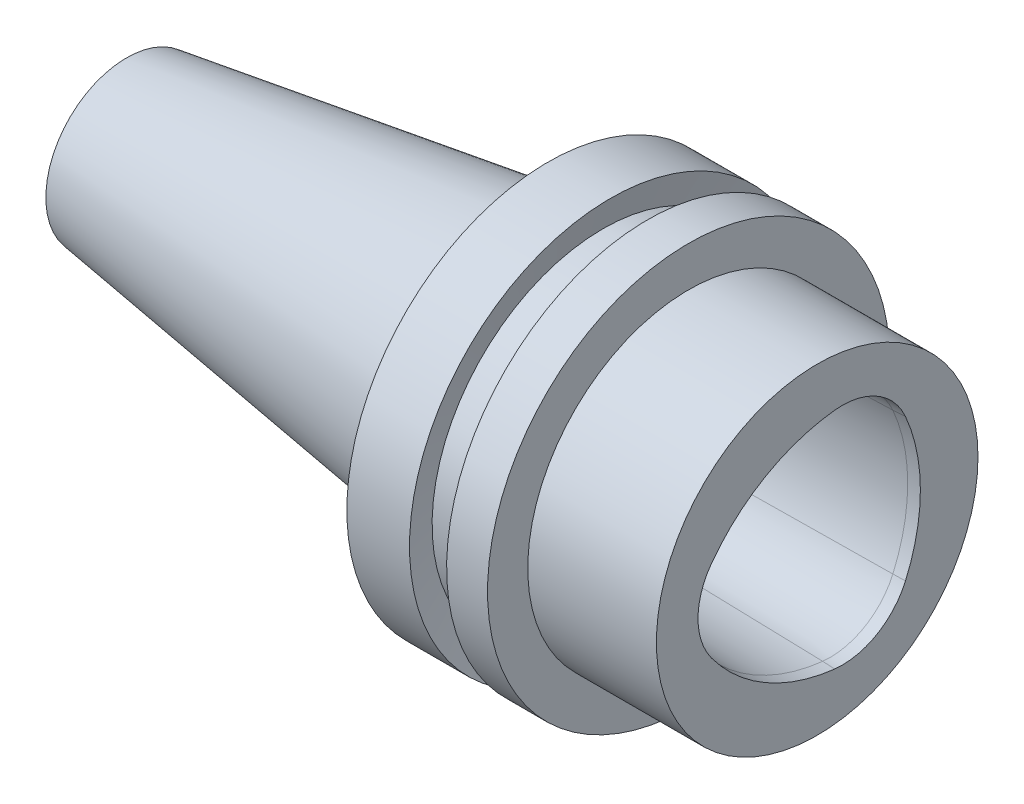
ISO-10303-21;
HEADER;
FILE_DESCRIPTION(('STEP AP214'),'2;1');
FILE_NAME('part.step','',(''),(''),'','','');
FILE_SCHEMA(('AUTOMOTIVE_DESIGN { 1 0 10303 214 1 1 1 1 }'));
ENDSEC;
DATA;
#1=APPLICATION_CONTEXT('core data for automotive mechanical design processes');
#2=APPLICATION_PROTOCOL_DEFINITION('international standard','automotive_design',2000,#1);
#3=PRODUCT_CONTEXT('',#1,'mechanical');
#4=PRODUCT('Part','Part','',(#3));
#5=PRODUCT_RELATED_PRODUCT_CATEGORY('part','',(#4));
#6=PRODUCT_DEFINITION_FORMATION('','',#4);
#7=PRODUCT_DEFINITION_CONTEXT('part definition',#1,'design');
#8=PRODUCT_DEFINITION('design','',#6,#7);
#9=PRODUCT_DEFINITION_SHAPE('','',#8);
#10=(LENGTH_UNIT() NAMED_UNIT(*) SI_UNIT(.MILLI.,.METRE.));
#11=(NAMED_UNIT(*) PLANE_ANGLE_UNIT() SI_UNIT($,.RADIAN.));
#12=(NAMED_UNIT(*) SI_UNIT($,.STERADIAN.) SOLID_ANGLE_UNIT());
#13=UNCERTAINTY_MEASURE_WITH_UNIT(LENGTH_MEASURE(1.E-05),#10,'distance_accuracy_value','');
#14=(GEOMETRIC_REPRESENTATION_CONTEXT(3) GLOBAL_UNCERTAINTY_ASSIGNED_CONTEXT((#13)) GLOBAL_UNIT_ASSIGNED_CONTEXT((#10,
#11,#12)) REPRESENTATION_CONTEXT('',''));
#15=CARTESIAN_POINT('',(0.,0.,0.));
#16=DIRECTION('',(0.,0.,1.));
#17=DIRECTION('',(1.,0.,0.));
#18=AXIS2_PLACEMENT_3D('',#15,#16,#17);
#19=CARTESIAN_POINT('',(25.75,0.,-22.8));
#20=DIRECTION('',(0.,0.,1.));
#21=DIRECTION('',(1.,0.,0.));
#22=AXIS2_PLACEMENT_3D('',#19,#20,#21);
#23=PLANE('',#22);
#24=CARTESIAN_POINT('',(27.,0.,-22.8));
#25=DIRECTION('',(0.,0.,-1.));
#26=DIRECTION('',(-1.,0.,0.));
#27=AXIS2_PLACEMENT_3D('',#24,#25,#26);
#28=CIRCLE('',#27,2.5);
#29=CARTESIAN_POINT('',(24.5,0.,-22.8));
#30=VERTEX_POINT('',#29);
#31=EDGE_CURVE('E20',#30,#30,#28,.T.);
#32=ORIENTED_EDGE('',*,*,#31,.F.);
#33=EDGE_LOOP('',(#32));
#34=FACE_BOUND('',#33,.T.);
#35=ADVANCED_FACE('F17',(#34),#23,.T.);
#36=CARTESIAN_POINT('',(27.,0.,-25.3));
#37=DIRECTION('',(0.,0.,-1.));
#38=DIRECTION('',(-1.,0.,0.));
#39=AXIS2_PLACEMENT_3D('',#36,#37,#38);
#40=CYLINDRICAL_SURFACE('',#39,2.5);
#41=CARTESIAN_POINT('',(26.9963479255715,2.49999727448949,-24.4373782922022));
#42=CARTESIAN_POINT('',(26.8562874872087,2.49978681515396,-24.4338662898597));
#43=CARTESIAN_POINT('',(26.7160432345764,2.48777117790548,-24.431041314058));
#44=CARTESIAN_POINT('',(26.4392778702586,2.44036415026063,-24.4267981769111));
#45=CARTESIAN_POINT('',(26.3027667703516,2.40491530630215,-24.4253834947609));
#46=CARTESIAN_POINT('',(26.0376214938538,2.31161826046223,-24.4238394123434));
#47=CARTESIAN_POINT('',(25.908987201397,2.25377038815713,-24.4237099931657));
#48=CARTESIAN_POINT('',(25.6634962503122,2.11740378525314,-24.4244792187997));
#49=CARTESIAN_POINT('',(25.5466114926672,2.03893607545566,-24.4253753441621));
#50=CARTESIAN_POINT('',(25.4012112416393,1.92250260740631,-24.4270132167991));
#51=CARTESIAN_POINT('',(25.3659850992527,1.89265044310711,-24.4274557100071));
#52=CARTESIAN_POINT('',(25.2972368338577,1.83104558803251,-24.4283997749567));
#53=CARTESIAN_POINT('',(25.2637147065103,1.79929290209686,-24.4289013465479));
#54=CARTESIAN_POINT('',(25.1319547024769,1.66735093939273,-24.4310194480522));
#55=CARTESIAN_POINT('',(25.0410747023009,1.55958471142369,-24.4328248029216));
#56=CARTESIAN_POINT('',(24.8785344151363,1.33012297220712,-24.4364639518422));
#57=CARTESIAN_POINT('',(24.8069222407918,1.20839365486559,-24.4382978052087));
#58=CARTESIAN_POINT('',(24.6851594568388,0.954630288405795,-24.4416312316744));
#59=CARTESIAN_POINT('',(24.6350091506115,0.822596093650762,-24.4431308000481));
#60=CARTESIAN_POINT('',(24.5577150201722,0.552212749473588,-24.4455158516912));
#61=CARTESIAN_POINT('',(24.5305145608083,0.413880038757602,-24.4464028456705));
#62=CARTESIAN_POINT('',(24.5100737472756,0.228863075493801,-24.4470730920903));
#63=CARTESIAN_POINT('',(24.50629877045,0.183177478555398,-24.4471973951505));
#64=CARTESIAN_POINT('',(24.501260938785,0.0916678291114066,-24.4473637636529));
#65=CARTESIAN_POINT('',(24.4999980842499,0.0458437765890402,-24.4474058290851));
#66=CARTESIAN_POINT('',(24.5000057064639,-0.140254296435099,-24.4474048693322));
#67=CARTESIAN_POINT('',(24.5118492279171,-0.280693208316733,-24.4470082044979));
#68=CARTESIAN_POINT('',(24.558966807912,-0.55784462591026,-24.445487538017));
#69=CARTESIAN_POINT('',(24.5942988759407,-0.694547031186498,-24.4443617358031));
#70=CARTESIAN_POINT('',(24.6874130124211,-0.96006993221565,-24.4415844984099));
#71=CARTESIAN_POINT('',(24.7451946031195,-1.08889059563419,-24.4399330744165));
#72=CARTESIAN_POINT('',(24.881479983005,-1.33474821306386,-24.4364165807679));
#73=CARTESIAN_POINT('',(24.9599322693489,-1.45181346913503,-24.4345520485389));
#74=CARTESIAN_POINT('',(25.0761991142842,-1.59721928922897,-24.4321857129731));
#75=CARTESIAN_POINT('',(25.1058642063645,-1.63228604366763,-24.4316106820115));
#76=CARTESIAN_POINT('',(25.1670775309834,-1.70073611449402,-24.4304916160765));
#77=CARTESIAN_POINT('',(25.1986257668797,-1.73411942787992,-24.4299475811584));
#78=CARTESIAN_POINT('',(25.3301412016824,-1.86579479426583,-24.4278338112479));
#79=CARTESIAN_POINT('',(25.4376932685537,-1.95674709343131,-24.4264495277013));
#80=CARTESIAN_POINT('',(25.6667369382471,-2.11948594964008,-24.4244821820184));
#81=CARTESIAN_POINT('',(25.788262274349,-2.1912246726932,-24.4239011048609));
#82=CARTESIAN_POINT('',(26.0416356108043,-2.31329048558499,-24.4238685176052));
#83=CARTESIAN_POINT('',(26.1734840303209,-2.3636167054463,-24.4244170533971));
#84=CARTESIAN_POINT('',(26.4435088560678,-2.44130697499142,-24.4268625212763));
#85=CARTESIAN_POINT('',(26.5816688541546,-2.46872734834933,-24.4287561245848));
#86=CARTESIAN_POINT('',(26.7666771832809,-2.48951545329609,-24.4322078647063));
#87=CARTESIAN_POINT('',(26.8125233043336,-2.49338476325338,-24.4331369508389));
#88=CARTESIAN_POINT('',(26.9043556449765,-2.49859304826145,-24.4351451036589));
#89=CARTESIAN_POINT('',(26.9503418641537,-2.49993203076242,-24.4362241699047));
#90=CARTESIAN_POINT('',(27.1366663107339,-2.50019650056097,-24.4408985824052));
#91=CARTESIAN_POINT('',(27.2771690947278,-2.4885472508978,-24.4451175273025));
#92=CARTESIAN_POINT('',(27.5544416958402,-2.44181011431252,-24.4547780724617));
#93=CARTESIAN_POINT('',(27.6912013753353,-2.40666408827142,-24.460222683224));
#94=CARTESIAN_POINT('',(27.9568307095316,-2.31392806180736,-24.4720022913566));
#95=CARTESIAN_POINT('',(28.0857010786321,-2.25634009705402,-24.4783372079353));
#96=CARTESIAN_POINT('',(28.3316799637278,-2.12044743970285,-24.4914448512989));
#97=CARTESIAN_POINT('',(28.448816558045,-2.04219391541053,-24.4982164659353));
#98=CARTESIAN_POINT('',(28.5948146647203,-1.9258088191688,-24.5071803193416));
#99=CARTESIAN_POINT('',(28.6303624782729,-1.89580599268093,-24.5094091191569));
#100=CARTESIAN_POINT('',(28.6997336658456,-1.8338668711139,-24.5138400879332));
#101=CARTESIAN_POINT('',(28.7335570342275,-1.80193056971394,-24.5160422568071));
#102=CARTESIAN_POINT('',(28.8656445893578,-1.670025124693,-24.5247895604899));
#103=CARTESIAN_POINT('',(28.9565988465977,-1.56249293088078,-24.5311553354115));
#104=CARTESIAN_POINT('',(29.1193622039857,-1.33345972024862,-24.5429556908744));
#105=CARTESIAN_POINT('',(29.1911238371696,-1.21192511472417,-24.5483879510237));
#106=CARTESIAN_POINT('',(29.3132495881539,-0.958471172936542,-24.5578478375088));
#107=CARTESIAN_POINT('',(29.3636110207554,-0.826550535941862,-24.5618752875641));
#108=CARTESIAN_POINT('',(29.4413513777757,-0.556322055419894,-24.5681665394507));
#109=CARTESIAN_POINT('',(29.4687867858405,-0.418030800589713,-24.5704346747707));
#110=CARTESIAN_POINT('',(29.4896170117526,-0.232342412923612,-24.5721606495022));
#111=CARTESIAN_POINT('',(29.4935078092178,-0.185965437647331,-24.5724836030797));
#112=CARTESIAN_POINT('',(29.4987002807453,-0.0930657192276746,-24.5729150776989));
#113=CARTESIAN_POINT('',(29.5000019528215,-0.0465429759725048,-24.573023598576));
#114=CARTESIAN_POINT('',(29.4999941261197,0.139996311222103,-24.5730222014867));
#115=CARTESIAN_POINT('',(29.4881938008996,0.280175608838178,-24.5720361644563));
#116=CARTESIAN_POINT('',(29.4412548700325,0.556804707778356,-24.5681702488841));
#117=CARTESIAN_POINT('',(29.406058978201,0.693244496591373,-24.5652857218874));
#118=CARTESIAN_POINT('',(29.3133260421062,0.958241207348469,-24.5578722901179));
#119=CARTESIAN_POINT('',(29.2557915331478,1.08679902193487,-24.5533435719551));
#120=CARTESIAN_POINT('',(29.1201144248748,1.3321774731471,-24.543036264604));
#121=CARTESIAN_POINT('',(29.0420219998441,1.44902574263615,-24.5372607245406));
#122=CARTESIAN_POINT('',(28.9254645753023,1.59524868410671,-24.5290336632474));
#123=CARTESIAN_POINT('',(28.8950470193213,1.63126242138212,-24.5269166195737));
#124=CARTESIAN_POINT('',(28.832230861975,1.70151413812496,-24.5226153395489));
#125=CARTESIAN_POINT('',(28.7998322683192,1.73575212450207,-24.5204311034592));
#126=CARTESIAN_POINT('',(28.6671232639126,1.86825651739904,-24.5116431061891));
#127=CARTESIAN_POINT('',(28.5592689488585,1.95918393198116,-24.5048451829294));
#128=CARTESIAN_POINT('',(28.3296118087106,2.12179244826655,-24.4913509068107));
#129=CARTESIAN_POINT('',(28.2077753304525,2.19342566476104,-24.484654844878));
#130=CARTESIAN_POINT('',(27.9537603768341,2.31520643224913,-24.471874550941));
#131=CARTESIAN_POINT('',(27.8215812738636,2.36535267817472,-24.4657903561172));
#132=CARTESIAN_POINT('',(27.5508711921681,2.44259641532495,-24.4546551396305));
#133=CARTESIAN_POINT('',(27.4123567828316,2.46975077134761,-24.4496015925771));
#134=CARTESIAN_POINT('',(27.2268259184004,2.49011853926941,-24.4437528868062));
#135=CARTESIAN_POINT('',(27.1808193559097,2.49387925241068,-24.4423767373474));
#136=CARTESIAN_POINT('',(27.0886644953449,2.49885331141774,-24.4397682723284));
#137=CARTESIAN_POINT('',(27.0425161967785,2.50006664842402,-24.4385359572683));
#138=CARTESIAN_POINT('',(26.9963479255715,2.49999727448949,-24.4373782922022));
#139=B_SPLINE_CURVE_WITH_KNOTS('',3,(#41,#42,#43,#44,#45,#46,#47,#48,#49,#50,#51,#52,#53,#54,
#55,#56,#57,#58,#59,#60,#61,#62,#63,#64,#65,#66,#67,#68,#69,#70,#71,#72,#73,#74,#75,#76,#77,#78,
#79,#80,#81,#82,#83,#84,#85,#86,#87,#88,#89,#90,#91,#92,#93,#94,#95,#96,#97,#98,#99,#100,#101,
#102,#103,#104,#105,#106,#107,#108,#109,#110,#111,#112,#113,#114,#115,#116,#117,#118,#119,#120,
#121,#122,#123,#124,#125,#126,#127,#128,#129,#130,#131,#132,#133,#134,#135,#136,#137,#138),
.UNSPECIFIED.,.T.,.F.,(4,2,2,2,2,2,2,2,2,2,2,2,2,2,2,2,2,2,2,2,2,2,2,2,2,2,2,2,2,2,2,2,2,2,2,2,
2,2,2,2,2,2,2,2,2,2,2,2,4),(0.,0.420139361800555,0.841312661462383,1.26247976427147,
1.68261440537088,1.82109158758216,1.9595684171713,2.38029239674866,2.80205739347101,
3.22382835199348,3.64455540309945,3.78203007417191,3.91950476190318,4.34009436075382,
4.76172656467512,5.18334979623645,5.60393229090011,5.74168730941921,5.87944257356639,
6.29980520159038,6.72120483336873,7.14262158473091,7.56299902954333,7.70100401465749,
7.8390085934349,8.25992252087419,8.68188180809427,9.10380282901987,9.52468880427872,
9.66434712321419,9.80400589873619,10.2247418858694,10.6465090063951,11.0683290327063,
11.4891067163645,11.6286769594553,11.7682473096141,12.1880601486482,12.6089047431257,
13.0297015881115,13.4494807945582,13.5909896196255,13.7324978940211,14.1539722007842,
14.5764830994117,14.9990196567204,15.4205080953117,15.5589985981702,15.6974895826841),.UNSPECIFIED.);
#140=CARTESIAN_POINT('',(26.9963479255715,2.49999727448949,-24.4373782922022));
#141=VERTEX_POINT('',#140);
#142=EDGE_CURVE('E129',#141,#141,#139,.T.);
#143=ORIENTED_EDGE('',*,*,#142,.T.);
#144=EDGE_LOOP('',(#143));
#145=FACE_BOUND('',#144,.T.);
#146=ORIENTED_EDGE('',*,*,#31,.T.);
#147=EDGE_LOOP('',(#146));
#148=FACE_BOUND('',#147,.T.);
#149=ADVANCED_FACE('F124',(#145,#148),#40,.T.);
#150=CARTESIAN_POINT('',(22.,0.,-8.13728991209E-07));
#151=DIRECTION('',(-1.,0.,0.));
#152=DIRECTION('',(0.,0.,1.));
#153=AXIS2_PLACEMENT_3D('',#150,#151,#152);
#154=PLANE('',#153);
#155=CARTESIAN_POINT('',(21.9999999999997,10.8253190516,-6.24999706097));
#156=DIRECTION('',(1.,0.,0.));
#157=DIRECTION('',(0.,0.,-1.));
#158=AXIS2_PLACEMENT_3D('',#155,#156,#157);
#159=CIRCLE('',#158,15.8694430297899);
#160=CARTESIAN_POINT('',(21.9999999999995,17.1879767216908,-20.7880784147457));
#161=VERTEX_POINT('',#160);
#162=CARTESIAN_POINT('',(22.0000000000016,26.5969955232125,-4.49117832371232));
#163=VERTEX_POINT('',#162);
#164=EDGE_CURVE('E141',#161,#163,#159,.T.);
#165=ORIENTED_EDGE('',*,*,#164,.T.);
#166=CARTESIAN_POINT('',(21.9999999999992,-16.0083350464,-9.24242423402));
#167=DIRECTION('',(1.,0.,0.));
#168=DIRECTION('',(0.,0.,-1.));
#169=AXIS2_PLACEMENT_3D('',#166,#167,#168);
#170=CIRCLE('',#169,42.8694358563899);
#171=CARTESIAN_POINT('',(22.0000000000028,9.4090182899139,25.2792599662088));
#172=VERTEX_POINT('',#171);
#173=EDGE_CURVE('E669',#163,#172,#170,.T.);
#174=ORIENTED_EDGE('',*,*,#173,.T.);
#175=CARTESIAN_POINT('',(22.000000000002,0.,12.4999941219));
#176=DIRECTION('',(1.,0.,0.));
#177=DIRECTION('',(0.,0.,-1.));
#178=AXIS2_PLACEMENT_3D('',#175,#176,#177);
#179=CIRCLE('',#178,15.86944424669);
#180=CARTESIAN_POINT('',(22.0000000000002,-9.40901834557404,25.2792599252022));
#181=VERTEX_POINT('',#180);
#182=EDGE_CURVE('E79',#172,#181,#179,.T.);
#183=ORIENTED_EDGE('',*,*,#182,.T.);
#184=CARTESIAN_POINT('',(22.0000000000002,16.0083350464,-9.24242423402));
#185=DIRECTION('',(1.,0.,0.));
#186=DIRECTION('',(0.,0.,-1.));
#187=AXIS2_PLACEMENT_3D('',#184,#185,#186);
#188=CIRCLE('',#187,42.8694358563899);
#189=CARTESIAN_POINT('',(21.9999999999987,-26.5969955129551,-4.49117823178815));
#190=VERTEX_POINT('',#189);
#191=EDGE_CURVE('E73',#181,#190,#188,.T.);
#192=ORIENTED_EDGE('',*,*,#191,.T.);
#193=CARTESIAN_POINT('',(21.9999999999988,-10.8253190516,-6.24999706097));
#194=DIRECTION('',(1.,0.,0.));
#195=DIRECTION('',(0.,0.,-1.));
#196=AXIS2_PLACEMENT_3D('',#193,#194,#195);
#197=CIRCLE('',#196,15.8694430297899);
#198=CARTESIAN_POINT('',(22.000000000001,-17.1879767002761,-20.788078424118));
#199=VERTEX_POINT('',#198);
#200=EDGE_CURVE('E76',#190,#199,#197,.T.);
#201=ORIENTED_EDGE('',*,*,#200,.T.);
#202=CARTESIAN_POINT('',(22.0000000000011,0.,18.484848468));
#203=DIRECTION('',(1.,0.,0.));
#204=DIRECTION('',(0.,0.,-1.));
#205=AXIS2_PLACEMENT_3D('',#202,#203,#204);
#206=CIRCLE('',#205,42.86944517629);
#207=EDGE_CURVE('E139',#199,#161,#206,.T.);
#208=ORIENTED_EDGE('',*,*,#207,.T.);
#209=EDGE_LOOP('',(#165,#174,#183,#192,#201,#208));
#210=FACE_BOUND('',#209,.T.);
#211=ADVANCED_FACE('F75',(#210),#154,.F.);
#212=CARTESIAN_POINT('',(67.,-10.8253190516,-6.24999706097));
#213=DIRECTION('',(1.,0.,0.));
#214=DIRECTION('',(0.,0.,-1.));
#215=AXIS2_PLACEMENT_3D('',#212,#213,#214);
#216=CONICAL_SURFACE('',#215,17.00000228,0.0251182549672);
#217=CARTESIAN_POINT('',(21.9999999999992,-26.5969957474347,-4.49118033446611));
#218=CARTESIAN_POINT('',(23.8749999999992,-26.6438121746028,-4.48595948699463));
#219=CARTESIAN_POINT('',(25.7499999999992,-26.6906286017736,-4.4807386395484));
#220=CARTESIAN_POINT('',(29.4999999999993,-26.784261456121,-4.47029694470644));
#221=CARTESIAN_POINT('',(31.3749999999993,-26.8310778832976,-4.46507609731071));
#222=CARTESIAN_POINT('',(35.1249999999993,-26.9247107376562,-4.45463440256976));
#223=CARTESIAN_POINT('',(36.9999999999994,-26.9715271648384,-4.44941355522454));
#224=CARTESIAN_POINT('',(40.7499999999994,-27.0651600192083,-4.4389718605846));
#225=CARTESIAN_POINT('',(42.6249999999994,-27.1119764463961,-4.43375101328988));
#226=CARTESIAN_POINT('',(46.3749999999995,-27.2056093007773,-4.42330931875095));
#227=CARTESIAN_POINT('',(48.2499999999995,-27.2524257279707,-4.41808847150674));
#228=CARTESIAN_POINT('',(51.9999999999996,-27.3460585823631,-4.40764677706883));
#229=CARTESIAN_POINT('',(53.8749999999996,-27.3928750095622,-4.40242592987512));
#230=CARTESIAN_POINT('',(57.6249999999996,-27.4865078639659,-4.39198423553822));
#231=CARTESIAN_POINT('',(59.4999999999997,-27.5333242911706,-4.38676338839502));
#232=CARTESIAN_POINT('',(63.2499999999997,-27.6269571455856,-4.37632169415912));
#233=CARTESIAN_POINT('',(65.1249999999997,-27.6737735727959,-4.37110084706643));
#234=CARTESIAN_POINT('',(66.9999999999998,-27.720590000009,-4.36587999999899));
#235=B_SPLINE_CURVE_WITH_KNOTS('',3,(#217,#218,#219,#220,#221,#222,#223,#224,#225,#226,#227,
#228,#229,#230,#231,#232,#233,#234),.UNSPECIFIED.,.F.,.F.,(4,2,2,2,2,2,2,2,4),(0.,
5.62677494804181,11.2535498960836,16.8803248441254,22.5070997921672,28.133874740209,
33.7606496882508,39.3874246362926,45.0141995843344),.UNSPECIFIED.);
#236=CARTESIAN_POINT('',(67.,-27.720590000012,-4.36587999999866));
#237=VERTEX_POINT('',#236);
#238=EDGE_CURVE('E86',#190,#237,#235,.T.);
#239=ORIENTED_EDGE('',*,*,#238,.T.);
#240=CARTESIAN_POINT('',(66.999999999999,-10.8253190516,-6.24999706097));
#241=DIRECTION('',(1.,0.,0.));
#242=DIRECTION('',(0.,0.866025383119938,0.500000035791964));
#243=AXIS2_PLACEMENT_3D('',#240,#241,#242);
#244=CIRCLE('',#243,17.00000228);
#245=CARTESIAN_POINT('',(67.,-17.6412600000021,-21.8237900000048));
#246=VERTEX_POINT('',#245);
#247=EDGE_CURVE('E230',#237,#246,#244,.T.);
#248=ORIENTED_EDGE('',*,*,#247,.T.);
#249=DIRECTION('',(-0.999684553219542,0.0100697960845852,0.0230085475651981));
#250=VECTOR('',#249,1.);
#251=CARTESIAN_POINT('',(67.,-17.6412600000023,-21.8237900000051));
#252=LINE('',#251,#250);
#253=EDGE_CURVE('E94',#246,#199,#252,.T.);
#254=ORIENTED_EDGE('',*,*,#253,.T.);
#255=ORIENTED_EDGE('',*,*,#200,.F.);
#256=EDGE_LOOP('',(#239,#248,#254,#255));
#257=FACE_BOUND('',#256,.T.);
#258=ADVANCED_FACE('F90',(#257),#216,.F.);
#259=CARTESIAN_POINT('',(67.,16.0083350464,-9.24242423402));
#260=DIRECTION('',(1.,0.,0.));
#261=DIRECTION('',(0.,0.,-1.));
#262=AXIS2_PLACEMENT_3D('',#259,#260,#261);
#263=CONICAL_SURFACE('',#262,43.9999951066,0.0251182549672);
#264=CARTESIAN_POINT('',(22.0000000000014,-9.40901967462809,25.2792589466567));
#265=CARTESIAN_POINT('',(23.8750000000014,-9.43694927184779,25.3171927403009));
#266=CARTESIAN_POINT('',(25.7500000000014,-9.46487886902619,25.3551265339757));
#267=CARTESIAN_POINT('',(29.5000000000013,-9.52073806330038,25.4309941213859));
#268=CARTESIAN_POINT('',(31.3750000000013,-9.54866766039617,25.4689279151215));
#269=CARTESIAN_POINT('',(35.1250000000013,-9.60452685450513,25.5447955026534));
#270=CARTESIAN_POINT('',(37.0000000000013,-9.6324564515183,25.5827292964497));
#271=CARTESIAN_POINT('',(40.7500000000013,-9.68831564546202,25.6585968841033));
#272=CARTESIAN_POINT('',(42.6250000000013,-9.71624524239257,25.6965306779605));
#273=CARTESIAN_POINT('',(46.3750000000013,-9.77210443617107,25.7723982657357));
#274=CARTESIAN_POINT('',(48.2500000000013,-9.80003403301901,25.8103320596537));
#275=CARTESIAN_POINT('',(52.0000000000013,-9.85589322663227,25.8861996475506));
#276=CARTESIAN_POINT('',(53.8750000000012,-9.88382282339759,25.9241334415295));
#277=CARTESIAN_POINT('',(57.6250000000012,-9.93968201684562,26.000001029548));
#278=CARTESIAN_POINT('',(59.5000000000012,-9.96761161352833,26.0379348235877));
#279=CARTESIAN_POINT('',(63.2500000000012,-10.0234708068111,26.1138024117278));
#280=CARTESIAN_POINT('',(65.1250000000012,-10.0514004034112,26.1517362058283));
#281=CARTESIAN_POINT('',(67.0000000000012,-10.07932999997,26.1896699999593));
#282=B_SPLINE_CURVE_WITH_KNOTS('',3,(#264,#265,#266,#267,#268,#269,#270,#271,#272,#273,#274,
#275,#276,#277,#278,#279,#280,#281),.UNSPECIFIED.,.F.,.F.,(4,2,2,2,2,2,2,2,4),(0.,
5.6267749480417,11.2535498960834,16.8803248441251,22.5070997921668,28.1338747402085,
33.7606496882502,39.3874246362919,45.0141995843336),.UNSPECIFIED.);
#283=CARTESIAN_POINT('',(67.0000000000029,-10.0793299999762,26.1896699999677));
#284=VERTEX_POINT('',#283);
#285=EDGE_CURVE('E85',#181,#284,#282,.T.);
#286=ORIENTED_EDGE('',*,*,#285,.T.);
#287=CARTESIAN_POINT('',(67.,16.0083350464,-9.24242423402));
#288=DIRECTION('',(1.,0.,0.));
#289=DIRECTION('',(0.,0.866025342638313,-0.500000105908181));
#290=AXIS2_PLACEMENT_3D('',#287,#288,#289);
#291=CIRCLE('',#290,43.9999951066);
#292=EDGE_CURVE('E100',#284,#237,#291,.T.);
#293=ORIENTED_EDGE('',*,*,#292,.T.);
#294=ORIENTED_EDGE('',*,*,#238,.F.);
#295=ORIENTED_EDGE('',*,*,#191,.F.);
#296=EDGE_LOOP('',(#286,#293,#294,#295));
#297=FACE_BOUND('',#296,.T.);
#298=ADVANCED_FACE('F98',(#297),#263,.F.);
#299=CARTESIAN_POINT('',(67.0000000000026,0.,12.4999941219));
#300=DIRECTION('',(1.,0.,0.));
#301=DIRECTION('',(0.,0.,-1.));
#302=AXIS2_PLACEMENT_3D('',#299,#300,#301);
#303=CONICAL_SURFACE('',#302,17.0000034969,0.0251182549672);
#304=CARTESIAN_POINT('',(22.000000000001,9.4090195633079,25.27925902867));
#305=CARTESIAN_POINT('',(23.8750000000009,9.43694916471416,25.3171928192319));
#306=CARTESIAN_POINT('',(25.7500000000009,9.4648787661357,25.3551266097825));
#307=CARTESIAN_POINT('',(29.5000000000009,9.52073796900937,25.4309941908612));
#308=CARTESIAN_POINT('',(31.3750000000008,9.5486675704615,25.4689279813892));
#309=CARTESIAN_POINT('',(35.1250000000008,9.60452677339637,25.5447955624229));
#310=CARTESIAN_POINT('',(37.0000000000007,9.6324563748791,25.5827293529284));
#311=CARTESIAN_POINT('',(40.7500000000007,9.68831557787514,25.658596933917));
#312=CARTESIAN_POINT('',(42.6250000000006,9.71624517938846,25.6965307244001));
#313=CARTESIAN_POINT('',(46.3750000000006,9.77210438244567,25.7723983053436));
#314=CARTESIAN_POINT('',(48.2500000000006,9.80003398398958,25.8103320958041));
#315=CARTESIAN_POINT('',(52.0000000000005,9.85589318710797,25.8861996767026));
#316=CARTESIAN_POINT('',(53.8750000000005,9.88382278868247,25.9241334671406));
#317=CARTESIAN_POINT('',(57.6250000000004,9.93968199186205,26.0000010479941));
#318=CARTESIAN_POINT('',(59.5000000000004,9.96761159346713,26.0379348384095));
#319=CARTESIAN_POINT('',(63.2500000000003,10.0234707967079,26.113802419218));
#320=CARTESIAN_POINT('',(65.1250000000003,10.0514003983436,26.1517362096109));
#321=CARTESIAN_POINT('',(67.0000000000003,10.0793299999945,26.1896699999926));
#322=B_SPLINE_CURVE_WITH_KNOTS('',3,(#304,#305,#306,#307,#308,#309,#310,#311,#312,#313,#314,
#315,#316,#317,#318,#319,#320,#321),.UNSPECIFIED.,.F.,.F.,(4,2,2,2,2,2,2,2,4),(0.,
5.62677494804164,11.2535498960833,16.8803248441249,22.5070997921665,28.1338747402082,
33.7606496882498,39.3874246362915,45.0141995843331),.UNSPECIFIED.);
#323=CARTESIAN_POINT('',(67.,10.0793299999884,26.1896699999843));
#324=VERTEX_POINT('',#323);
#325=EDGE_CURVE('E205',#172,#324,#322,.T.);
#326=ORIENTED_EDGE('',*,*,#325,.T.);
#327=CARTESIAN_POINT('',(67.0000000000026,0.,12.4999941219));
#328=DIRECTION('',(1.,0.,0.));
#329=DIRECTION('',(0.,0.,-1.));
#330=AXIS2_PLACEMENT_3D('',#327,#328,#329);
#331=CIRCLE('',#330,17.0000034969001);
#332=EDGE_CURVE('E191',#324,#284,#331,.T.);
#333=ORIENTED_EDGE('',*,*,#332,.T.);
#334=ORIENTED_EDGE('',*,*,#285,.F.);
#335=ORIENTED_EDGE('',*,*,#182,.F.);
#336=EDGE_LOOP('',(#326,#333,#334,#335));
#337=FACE_BOUND('',#336,.T.);
#338=ADVANCED_FACE('F209',(#337),#303,.F.);
#339=CARTESIAN_POINT('',(67.,-16.0083350464,-9.24242423402));
#340=DIRECTION('',(1.,0.,0.));
#341=DIRECTION('',(0.,0.,-1.));
#342=AXIS2_PLACEMENT_3D('',#339,#340,#341);
#343=CONICAL_SURFACE('',#342,43.9999951066,0.0251182549672001);
#344=CARTESIAN_POINT('',(21.9999999999988,26.5969957679491,-4.49118051831453));
#345=CARTESIAN_POINT('',(23.8749999999988,26.6438121943463,-4.48595966393037));
#346=CARTESIAN_POINT('',(25.7499999999988,26.6906286207359,-4.48073880947801));
#347=CARTESIAN_POINT('',(29.4999999999989,26.7842614734998,-4.47029710043684));
#348=CARTESIAN_POINT('',(31.3749999999989,26.8310778998742,-4.46507624584804));
#349=CARTESIAN_POINT('',(35.124999999999,26.9247107526077,-4.45463453653401));
#350=CARTESIAN_POINT('',(36.999999999999,26.9715271789668,-4.44941368180878));
#351=CARTESIAN_POINT('',(40.749999999999,27.0651600316699,-4.4389719722219));
#352=CARTESIAN_POINT('',(42.6249999999991,27.1119764580138,-4.43375111736024));
#353=CARTESIAN_POINT('',(46.3749999999991,27.2056093106865,-4.4233094075005));
#354=CARTESIAN_POINT('',(48.2499999999991,27.2524257370152,-4.41808855250242));
#355=CARTESIAN_POINT('',(51.9999999999992,27.3460585896574,-4.40764684236982));
#356=CARTESIAN_POINT('',(53.8749999999992,27.3928750159709,-4.40242598723531));
#357=CARTESIAN_POINT('',(57.6249999999993,27.4865078685827,-4.39198427682986));
#358=CARTESIAN_POINT('',(59.4999999999993,27.533324294881,-4.38676342155891));
#359=CARTESIAN_POINT('',(63.2499999999993,27.6269571474624,-4.3763217108806));
#360=CARTESIAN_POINT('',(65.1249999999994,27.6737735737455,-4.37110085547323));
#361=CARTESIAN_POINT('',(66.9999999999994,27.720590000021,-4.36587999999765));
#362=B_SPLINE_CURVE_WITH_KNOTS('',3,(#344,#345,#346,#347,#348,#349,#350,#351,#352,#353,#354,
#355,#356,#357,#358,#359,#360,#361),.UNSPECIFIED.,.F.,.F.,(4,2,2,2,2,2,2,2,4),(0.,
5.62677494804181,11.2535498960836,16.8803248441254,22.5070997921672,28.133874740209,
33.7606496882508,39.3874246362926,45.0141995843344),.UNSPECIFIED.);
#363=CARTESIAN_POINT('',(67.,27.720590000018,-4.36587999999799));
#364=VERTEX_POINT('',#363);
#365=EDGE_CURVE('E182',#163,#364,#362,.T.);
#366=ORIENTED_EDGE('',*,*,#365,.T.);
#367=CARTESIAN_POINT('',(67.,-16.0083350464,-9.24242423402));
#368=DIRECTION('',(1.,0.,0.));
#369=DIRECTION('',(0.,-0.866025342638313,-0.500000105908181));
#370=AXIS2_PLACEMENT_3D('',#367,#368,#369);
#371=CIRCLE('',#370,43.9999951066);
#372=EDGE_CURVE('E167',#364,#324,#371,.T.);
#373=ORIENTED_EDGE('',*,*,#372,.T.);
#374=ORIENTED_EDGE('',*,*,#325,.F.);
#375=ORIENTED_EDGE('',*,*,#173,.F.);
#376=EDGE_LOOP('',(#366,#373,#374,#375));
#377=FACE_BOUND('',#376,.T.);
#378=ADVANCED_FACE('F186',(#377),#343,.F.);
#379=CARTESIAN_POINT('',(67.,10.8253190516,-6.24999706097));
#380=DIRECTION('',(1.,0.,0.));
#381=DIRECTION('',(0.,0.,-1.));
#382=AXIS2_PLACEMENT_3D('',#379,#380,#381);
#383=CONICAL_SURFACE('',#382,17.00000228,0.0251182549672);
#384=CARTESIAN_POINT('',(21.9999999999996,17.1879762321066,-20.7880786290151));
#385=CARTESIAN_POINT('',(23.8749999999996,17.206863055816,-20.8312332694524));
#386=CARTESIAN_POINT('',(25.7499999999996,17.2257498795195,-20.8743879098923));
#387=CARTESIAN_POINT('',(29.4999999999996,17.2635235269147,-20.9606971907773));
#388=CARTESIAN_POINT('',(31.3749999999996,17.2824103506065,-21.0038518312223));
#389=CARTESIAN_POINT('',(35.1249999999996,17.3201839979782,-21.0901611121175));
#390=CARTESIAN_POINT('',(36.9999999999997,17.3390708216581,-21.1333157525677));
#391=CARTESIAN_POINT('',(40.7499999999997,17.3768444690063,-21.2196250334733));
#392=CARTESIAN_POINT('',(42.6249999999997,17.3957312926745,-21.2627796739286));
#393=CARTESIAN_POINT('',(46.3749999999997,17.4335049399991,-21.3490889548444));
#394=CARTESIAN_POINT('',(48.2499999999997,17.4523917636555,-21.3922435953049));
#395=CARTESIAN_POINT('',(51.9999999999997,17.4901654109567,-21.4785528762311));
#396=CARTESIAN_POINT('',(53.8749999999997,17.5090522346013,-21.5217075166967));
#397=CARTESIAN_POINT('',(57.6249999999998,17.5468258818789,-21.6080167976331));
#398=CARTESIAN_POINT('',(59.4999999999998,17.5657127055118,-21.6511714381039));
#399=CARTESIAN_POINT('',(63.2499999999998,17.6034863527658,-21.7374807190506));
#400=CARTESIAN_POINT('',(65.1249999999998,17.622373176387,-21.7806353595266));
#401=CARTESIAN_POINT('',(66.9999999999998,17.6412600000022,-21.8237900000051));
#402=B_SPLINE_CURVE_WITH_KNOTS('',3,(#384,#385,#386,#387,#388,#389,#390,#391,#392,#393,#394,
#395,#396,#397,#398,#399,#400,#401),.UNSPECIFIED.,.F.,.F.,(4,2,2,2,2,2,2,2,4),(0.,
5.62677494804174,11.2535498960835,16.8803248441253,22.507099792167,28.1338747402088,
33.7606496882505,39.3874246362923,45.014199584334),.UNSPECIFIED.);
#403=CARTESIAN_POINT('',(67.,17.6412600000021,-21.8237900000048));
#404=VERTEX_POINT('',#403);
#405=EDGE_CURVE('E138',#161,#404,#402,.T.);
#406=ORIENTED_EDGE('',*,*,#405,.T.);
#407=CARTESIAN_POINT('',(67.,10.8253190516,-6.24999706097));
#408=DIRECTION('',(1.,0.,0.));
#409=DIRECTION('',(0.,-0.866025383119938,0.500000035791964));
#410=AXIS2_PLACEMENT_3D('',#407,#408,#409);
#411=CIRCLE('',#410,17.00000228);
#412=EDGE_CURVE('E258',#404,#364,#411,.T.);
#413=ORIENTED_EDGE('',*,*,#412,.T.);
#414=ORIENTED_EDGE('',*,*,#365,.F.);
#415=ORIENTED_EDGE('',*,*,#164,.F.);
#416=EDGE_LOOP('',(#406,#413,#414,#415));
#417=FACE_BOUND('',#416,.T.);
#418=ADVANCED_FACE('F149',(#417),#383,.F.);
#419=CARTESIAN_POINT('',(67.,0.,18.484848468));
#420=DIRECTION('',(1.,0.,0.));
#421=DIRECTION('',(0.,0.,-1.));
#422=AXIS2_PLACEMENT_3D('',#419,#420,#421);
#423=CONICAL_SURFACE('',#422,44.0000044265,0.0251182549672);
#424=ORIENTED_EDGE('',*,*,#142,.F.);
#425=EDGE_LOOP('',(#424));
#426=FACE_BOUND('',#425,.T.);
#427=ORIENTED_EDGE('',*,*,#253,.F.);
#428=CARTESIAN_POINT('',(67.,0.,18.484848468));
#429=DIRECTION('',(1.,0.,0.));
#430=DIRECTION('',(0.,0.,1.));
#431=AXIS2_PLACEMENT_3D('',#428,#429,#430);
#432=CIRCLE('',#431,44.0000044265);
#433=EDGE_CURVE('E251',#246,#404,#432,.T.);
#434=ORIENTED_EDGE('',*,*,#433,.T.);
#435=ORIENTED_EDGE('',*,*,#405,.F.);
#436=ORIENTED_EDGE('',*,*,#207,.F.);
#437=EDGE_LOOP('',(#427,#434,#435,#436));
#438=FACE_BOUND('',#437,.T.);
#439=ADVANCED_FACE('F143',(#426,#438),#423,.F.);
#440=CARTESIAN_POINT('',(69.9999999999979,-10.8253190516,-6.24999706097));
#441=DIRECTION('',(1.,0.,0.));
#442=DIRECTION('',(0.,0.,-1.));
#443=AXIS2_PLACEMENT_3D('',#440,#441,#442);
#444=CONICAL_SURFACE('',#443,17.150838720147,0.050236509934499);
#445=DIRECTION('',(-0.998738411891505,0.0499060211339112,-0.00556539908870891));
#446=VECTOR('',#445,1.);
#447=CARTESIAN_POINT('',(67.,-27.720590000009,-4.36587999999899));
#448=LINE('',#447,#446);
#449=CARTESIAN_POINT('',(69.9999999999981,-27.8704969324798,-4.34916045220095));
#450=VERTEX_POINT('',#449);
#451=EDGE_CURVE('E220',#237,#450,#448,.F.);
#452=ORIENTED_EDGE('',*,*,#451,.T.);
#453=CARTESIAN_POINT('',(69.999999999998,-10.8253190516,-6.24999706097));
#454=DIRECTION('',(1.,0.,0.));
#455=DIRECTION('',(0.,0.,-1.));
#456=AXIS2_PLACEMENT_3D('',#453,#454,#455);
#457=CIRCLE('',#456,17.150838720147);
#458=CARTESIAN_POINT('',(70.,-17.7017365368368,-21.9619718373387));
#459=VERTEX_POINT('',#458);
#460=EDGE_CURVE('E255',#459,#450,#457,.F.);
#461=ORIENTED_EDGE('',*,*,#460,.F.);
#462=CARTESIAN_POINT('',(69.9999999999992,-17.7017360077068,-21.9619720689155));
#463=CARTESIAN_POINT('',(69.8749999999992,-17.6992161740533,-21.9562144827105));
#464=CARTESIAN_POINT('',(69.7499999999993,-17.6966963403996,-21.9504568965056));
#465=CARTESIAN_POINT('',(69.4999999999993,-17.6916566730921,-21.9389417240959));
#466=CARTESIAN_POINT('',(69.3749999999992,-17.6891368394383,-21.9331841378911));
#467=CARTESIAN_POINT('',(69.1249999999993,-17.6840971721304,-21.9216689654815));
#468=CARTESIAN_POINT('',(68.9999999999993,-17.6815773384763,-21.9159113792768));
#469=CARTESIAN_POINT('',(68.7499999999994,-17.676537671168,-21.9043962068674));
#470=CARTESIAN_POINT('',(68.6249999999994,-17.6740178375138,-21.8986386206628));
#471=CARTESIAN_POINT('',(68.3749999999995,-17.6689781702051,-21.8871234482535));
#472=CARTESIAN_POINT('',(68.2499999999994,-17.6664583365506,-21.881365862049));
#473=CARTESIAN_POINT('',(67.9999999999994,-17.6614186692415,-21.86985068964));
#474=CARTESIAN_POINT('',(67.8749999999995,-17.6588988355868,-21.8640931034355));
#475=CARTESIAN_POINT('',(67.6249999999996,-17.6538591682773,-21.8525779310266));
#476=CARTESIAN_POINT('',(67.4999999999996,-17.6513393346224,-21.8468203448223));
#477=CARTESIAN_POINT('',(67.2499999999997,-17.6462996673125,-21.8353051724136));
#478=CARTESIAN_POINT('',(67.1249999999996,-17.6437798336574,-21.8295475862093));
#479=CARTESIAN_POINT('',(66.9999999999996,-17.6412600000023,-21.8237900000051));
#480=B_SPLINE_CURVE_WITH_KNOTS('',3,(#462,#463,#464,#465,#466,#467,#468,#469,#470,#471,#472,
#473,#474,#475,#476,#477,#478,#479),.UNSPECIFIED.,.F.,.F.,(4,2,2,2,2,2,2,2,4),(0.,
0.375473693146188,0.750947386292598,1.12642107943878,1.50189477258497,1.87736846573138,
2.25284215887757,2.62831585202376,3.00378954517017),.UNSPECIFIED.);
#481=EDGE_CURVE('E256',#459,#246,#480,.T.);
#482=ORIENTED_EDGE('',*,*,#481,.T.);
#483=ORIENTED_EDGE('',*,*,#247,.F.);
#484=EDGE_LOOP('',(#452,#461,#482,#483));
#485=FACE_BOUND('',#484,.T.);
#486=ADVANCED_FACE('F148',(#485),#444,.F.);
#487=CARTESIAN_POINT('',(69.9999999999987,16.0083350464,-9.24242423402));
#488=DIRECTION('',(1.,0.,0.));
#489=DIRECTION('',(0.,0.,-1.));
#490=AXIS2_PLACEMENT_3D('',#487,#488,#489);
#491=CONICAL_SURFACE('',#490,44.150831546747,0.0502365099344977);
#492=DIRECTION('',(-0.998738411891505,0.029772782614784,-0.0404371862004245));
#493=VECTOR('',#492,1.);
#494=CARTESIAN_POINT('',(67.,-10.07932999997,26.1896699999592));
#495=LINE('',#494,#493);
#496=CARTESIAN_POINT('',(70.,-10.1687597969072,26.3111358103706));
#497=VERTEX_POINT('',#496);
#498=EDGE_CURVE('E200',#284,#497,#495,.F.);
#499=ORIENTED_EDGE('',*,*,#498,.T.);
#500=CARTESIAN_POINT('',(69.9999999999987,16.0083350464,-9.24242423402));
#501=DIRECTION('',(1.,0.,0.));
#502=DIRECTION('',(0.,0.,-1.));
#503=AXIS2_PLACEMENT_3D('',#500,#501,#502);
#504=CIRCLE('',#503,44.150831546747);
#505=EDGE_CURVE('E295',#450,#497,#504,.F.);
#506=ORIENTED_EDGE('',*,*,#505,.F.);
#507=ORIENTED_EDGE('',*,*,#451,.F.);
#508=ORIENTED_EDGE('',*,*,#292,.F.);
#509=EDGE_LOOP('',(#499,#506,#507,#508));
#510=FACE_BOUND('',#509,.T.);
#511=ADVANCED_FACE('F293',(#510),#491,.F.);
#512=CARTESIAN_POINT('',(70.0000000000035,0.,12.4999941219));
#513=DIRECTION('',(1.,0.,0.));
#514=DIRECTION('',(0.,0.,-1.));
#515=AXIS2_PLACEMENT_3D('',#512,#513,#514);
#516=CONICAL_SURFACE('',#515,17.1508399370473,0.0502365099345011);
#517=DIRECTION('',(-0.998738411891505,-0.0297727776696554,-0.0404371898413856));
#518=VECTOR('',#517,1.);
#519=CARTESIAN_POINT('',(67.,10.0793299999945,26.1896699999926));
#520=LINE('',#519,#518);
#521=CARTESIAN_POINT('',(70.0000000000024,10.1687597895047,26.3111358158723));
#522=VERTEX_POINT('',#521);
#523=EDGE_CURVE('E177',#324,#522,#520,.F.);
#524=ORIENTED_EDGE('',*,*,#523,.T.);
#525=CARTESIAN_POINT('',(70.0000000000027,0.,12.4999941219));
#526=DIRECTION('',(1.,0.,0.));
#527=DIRECTION('',(0.,0.,-1.));
#528=AXIS2_PLACEMENT_3D('',#525,#526,#527);
#529=CIRCLE('',#528,17.1508399370473);
#530=EDGE_CURVE('E305',#497,#522,#529,.F.);
#531=ORIENTED_EDGE('',*,*,#530,.F.);
#532=ORIENTED_EDGE('',*,*,#498,.F.);
#533=ORIENTED_EDGE('',*,*,#332,.F.);
#534=EDGE_LOOP('',(#524,#531,#532,#533));
#535=FACE_BOUND('',#534,.T.);
#536=ADVANCED_FACE('F395',(#535),#516,.F.);
#537=CARTESIAN_POINT('',(70.0000000000017,-16.0083350464,-9.24242423402));
#538=DIRECTION('',(1.,0.,0.));
#539=DIRECTION('',(0.,0.,-1.));
#540=AXIS2_PLACEMENT_3D('',#537,#538,#539);
#541=CONICAL_SURFACE('',#540,44.1508315467472,0.0502365099344973);
#542=DIRECTION('',(-0.998738411891505,-0.0499060220445216,-0.0055653909230815));
#543=VECTOR('',#542,1.);
#544=CARTESIAN_POINT('',(67.,27.720590000021,-4.36587999999766));
#545=LINE('',#544,#543);
#546=CARTESIAN_POINT('',(70.0000000000017,27.8704969338597,-4.34916046446349));
#547=VERTEX_POINT('',#546);
#548=EDGE_CURVE('E176',#364,#547,#545,.F.);
#549=ORIENTED_EDGE('',*,*,#548,.T.);
#550=CARTESIAN_POINT('',(69.9999999999987,-16.0083350464,-9.24242423402));
#551=DIRECTION('',(1.,0.,0.));
#552=DIRECTION('',(0.,0.,-1.));
#553=AXIS2_PLACEMENT_3D('',#550,#551,#552);
#554=CIRCLE('',#553,44.150831546747);
#555=EDGE_CURVE('E310',#522,#547,#554,.F.);
#556=ORIENTED_EDGE('',*,*,#555,.F.);
#557=ORIENTED_EDGE('',*,*,#523,.F.);
#558=ORIENTED_EDGE('',*,*,#372,.F.);
#559=EDGE_LOOP('',(#549,#556,#557,#558));
#560=FACE_BOUND('',#559,.T.);
#561=ADVANCED_FACE('F391',(#560),#541,.F.);
#562=CARTESIAN_POINT('',(69.999999999999,10.8253190516,-6.24999706097));
#563=DIRECTION('',(1.,0.,0.));
#564=DIRECTION('',(0.,0.,-1.));
#565=AXIS2_PLACEMENT_3D('',#562,#563,#564);
#566=CONICAL_SURFACE('',#565,17.150838720147,0.0502365099344983);
#567=DIRECTION('',(-0.998738411891505,-0.0201332391997009,0.0460025791859828));
#568=VECTOR('',#567,1.);
#569=CARTESIAN_POINT('',(67.,17.6412600000023,-21.8237900000051));
#570=LINE('',#569,#568);
#571=CARTESIAN_POINT('',(69.9999999999981,17.701736539694,-21.9619718360888));
#572=VERTEX_POINT('',#571);
#573=EDGE_CURVE('E261',#404,#572,#570,.F.);
#574=ORIENTED_EDGE('',*,*,#573,.T.);
#575=CARTESIAN_POINT('',(69.999999999998,10.8253190516,-6.24999706097));
#576=DIRECTION('',(1.,0.,0.));
#577=DIRECTION('',(0.,0.,-1.));
#578=AXIS2_PLACEMENT_3D('',#575,#576,#577);
#579=CIRCLE('',#578,17.150838720147);
#580=EDGE_CURVE('E315',#547,#572,#579,.F.);
#581=ORIENTED_EDGE('',*,*,#580,.F.);
#582=ORIENTED_EDGE('',*,*,#548,.F.);
#583=ORIENTED_EDGE('',*,*,#412,.F.);
#584=EDGE_LOOP('',(#574,#581,#582,#583));
#585=FACE_BOUND('',#584,.T.);
#586=ADVANCED_FACE('F388',(#585),#566,.F.);
#587=CARTESIAN_POINT('',(69.9999999999992,0.,18.484848468));
#588=DIRECTION('',(1.,0.,0.));
#589=DIRECTION('',(0.,1.,0.));
#590=AXIS2_PLACEMENT_3D('',#587,#588,#589);
#591=CONICAL_SURFACE('',#590,44.1508408666471,0.050236509934501);
#592=ORIENTED_EDGE('',*,*,#481,.F.);
#593=CARTESIAN_POINT('',(69.9999999999977,0.,18.484848468));
#594=DIRECTION('',(1.,0.,0.));
#595=DIRECTION('',(0.,1.,0.));
#596=AXIS2_PLACEMENT_3D('',#593,#594,#595);
#597=CIRCLE('',#596,44.150840866647);
#598=EDGE_CURVE('E36',#572,#459,#597,.F.);
#599=ORIENTED_EDGE('',*,*,#598,.F.);
#600=ORIENTED_EDGE('',*,*,#573,.F.);
#601=ORIENTED_EDGE('',*,*,#433,.F.);
#602=EDGE_LOOP('',(#592,#599,#600,#601));
#603=FACE_BOUND('',#602,.T.);
#604=ADVANCED_FACE('F378',(#603),#591,.F.);
#605=CARTESIAN_POINT('',(70.,20.,0.));
#606=DIRECTION('',(1.,0.,0.));
#607=DIRECTION('',(0.,0.,-1.));
#608=AXIS2_PLACEMENT_3D('',#605,#606,#607);
#609=PLANE('',#608);
#610=ORIENTED_EDGE('',*,*,#580,.T.);
#611=ORIENTED_EDGE('',*,*,#598,.T.);
#612=ORIENTED_EDGE('',*,*,#460,.T.);
#613=ORIENTED_EDGE('',*,*,#505,.T.);
#614=ORIENTED_EDGE('',*,*,#530,.T.);
#615=ORIENTED_EDGE('',*,*,#555,.T.);
#616=EDGE_LOOP('',(#610,#611,#612,#613,#614,#615));
#617=FACE_BOUND('',#616,.T.);
#618=CARTESIAN_POINT('',(70.,0.,0.));
#619=DIRECTION('',(1.,0.,0.));
#620=DIRECTION('',(0.,0.,-1.));
#621=AXIS2_PLACEMENT_3D('',#618,#619,#620);
#622=CIRCLE('',#621,40.);
#623=CARTESIAN_POINT('',(70.,0.,-40.));
#624=VERTEX_POINT('',#623);
#625=EDGE_CURVE('E320',#624,#624,#622,.F.);
#626=ORIENTED_EDGE('',*,*,#625,.F.);
#627=EDGE_LOOP('',(#626));
#628=FACE_BOUND('',#627,.T.);
#629=ADVANCED_FACE('F303',(#617,#628),#609,.T.);
#630=CARTESIAN_POINT('',(54.,0.,0.));
#631=DIRECTION('',(1.,0.,0.));
#632=DIRECTION('',(0.,0.,-1.));
#633=AXIS2_PLACEMENT_3D('',#630,#631,#632);
#634=CYLINDRICAL_SURFACE('',#633,40.);
#635=ORIENTED_EDGE('',*,*,#625,.T.);
#636=EDGE_LOOP('',(#635));
#637=FACE_BOUND('',#636,.T.);
#638=CARTESIAN_POINT('',(38.,0.,0.));
#639=DIRECTION('',(1.,0.,0.));
#640=DIRECTION('',(0.,0.,-1.));
#641=AXIS2_PLACEMENT_3D('',#638,#639,#640);
#642=CIRCLE('',#641,40.);
#643=CARTESIAN_POINT('',(38.,0.,-40.));
#644=VERTEX_POINT('',#643);
#645=EDGE_CURVE('E324',#644,#644,#642,.F.);
#646=ORIENTED_EDGE('',*,*,#645,.F.);
#647=EDGE_LOOP('',(#646));
#648=FACE_BOUND('',#647,.T.);
#649=ADVANCED_FACE('F453',(#637,#648),#634,.T.);
#650=CARTESIAN_POINT('',(38.,25.,0.));
#651=DIRECTION('',(1.,0.,0.));
#652=DIRECTION('',(0.,0.,-1.));
#653=AXIS2_PLACEMENT_3D('',#650,#651,#652);
#654=PLANE('',#653);
#655=ORIENTED_EDGE('',*,*,#645,.T.);
#656=EDGE_LOOP('',(#655));
#657=FACE_BOUND('',#656,.T.);
#658=CARTESIAN_POINT('',(37.9999999993,0.,0.));
#659=DIRECTION('',(1.,0.,0.));
#660=DIRECTION('',(0.,0.,-1.));
#661=AXIS2_PLACEMENT_3D('',#658,#659,#660);
#662=CIRCLE('',#661,50.);
#663=CARTESIAN_POINT('',(37.9999999993,0.,-50.));
#664=VERTEX_POINT('',#663);
#665=EDGE_CURVE('E328',#664,#664,#662,.F.);
#666=ORIENTED_EDGE('',*,*,#665,.F.);
#667=EDGE_LOOP('',(#666));
#668=FACE_BOUND('',#667,.T.);
#669=ADVANCED_FACE('F450',(#657,#668),#654,.T.);
#670=CARTESIAN_POINT('',(32.9065143254,0.,0.));
#671=DIRECTION('',(1.,0.,0.));
#672=DIRECTION('',(0.,0.,-1.));
#673=AXIS2_PLACEMENT_3D('',#670,#671,#672);
#674=CYLINDRICAL_SURFACE('',#673,50.);
#675=ORIENTED_EDGE('',*,*,#665,.T.);
#676=EDGE_LOOP('',(#675));
#677=FACE_BOUND('',#676,.T.);
#678=CARTESIAN_POINT('',(27.8130286451452,0.,0.));
#679=DIRECTION('',(-1.,0.,0.));
#680=DIRECTION('',(0.,-1.,0.));
#681=AXIS2_PLACEMENT_3D('',#678,#679,#680);
#682=CIRCLE('',#681,49.9999999986114);
#683=CARTESIAN_POINT('',(27.8130286451452,-49.9999999986114,0.));
#684=VERTEX_POINT('',#683);
#685=EDGE_CURVE('E332',#684,#684,#682,.F.);
#686=ORIENTED_EDGE('',*,*,#685,.T.);
#687=EDGE_LOOP('',(#686));
#688=FACE_BOUND('',#687,.T.);
#689=ADVANCED_FACE('F446',(#677,#688),#674,.T.);
#690=CARTESIAN_POINT('',(27.8130286451452,0.,0.));
#691=DIRECTION('',(-1.,0.,0.));
#692=DIRECTION('',(0.,0.,1.));
#693=AXIS2_PLACEMENT_3D('',#690,#691,#692);
#694=CONICAL_SURFACE('',#693,49.9999999986114,1.32491911887);
#695=ORIENTED_EDGE('',*,*,#685,.F.);
#696=EDGE_LOOP('',(#695));
#697=FACE_BOUND('',#696,.T.);
#698=CARTESIAN_POINT('',(29.6951905292,0.,0.));
#699=DIRECTION('',(1.,0.,0.));
#700=DIRECTION('',(0.,0.,-1.));
#701=AXIS2_PLACEMENT_3D('',#698,#699,#700);
#702=CIRCLE('',#701,42.5);
#703=CARTESIAN_POINT('',(29.6951905292,0.,-42.5));
#704=VERTEX_POINT('',#703);
#705=EDGE_CURVE('E363',#704,#704,#702,.F.);
#706=ORIENTED_EDGE('',*,*,#705,.F.);
#707=EDGE_LOOP('',(#706));
#708=FACE_BOUND('',#707,.T.);
#709=ADVANCED_FACE('F442',(#697,#708),#694,.F.);
#710=CARTESIAN_POINT('',(23.2,0.,0.));
#711=DIRECTION('',(1.,0.,0.));
#712=DIRECTION('',(0.,0.,-1.));
#713=AXIS2_PLACEMENT_3D('',#710,#711,#712);
#714=CYLINDRICAL_SURFACE('',#713,42.5);
#715=ORIENTED_EDGE('',*,*,#705,.T.);
#716=EDGE_LOOP('',(#715));
#717=FACE_BOUND('',#716,.T.);
#718=CARTESIAN_POINT('',(16.7048094659453,0.,0.));
#719=DIRECTION('',(1.,0.,0.));
#720=DIRECTION('',(0.,1.,0.));
#721=AXIS2_PLACEMENT_3D('',#718,#719,#720);
#722=CIRCLE('',#721,42.5000000013887);
#723=CARTESIAN_POINT('',(16.7048094659453,42.5000000013887,0.));
#724=VERTEX_POINT('',#723);
#725=EDGE_CURVE('E359',#724,#724,#722,.T.);
#726=ORIENTED_EDGE('',*,*,#725,.T.);
#727=EDGE_LOOP('',(#726));
#728=FACE_BOUND('',#727,.T.);
#729=ADVANCED_FACE('F438',(#717,#728),#714,.T.);
#730=CARTESIAN_POINT('',(18.5869713548712,0.,0.));
#731=DIRECTION('',(1.,0.,0.));
#732=DIRECTION('',(0.,0.,-1.));
#733=AXIS2_PLACEMENT_3D('',#730,#731,#732);
#734=CONICAL_SURFACE('',#733,49.9999999986772,1.32491911887);
#735=ORIENTED_EDGE('',*,*,#725,.F.);
#736=EDGE_LOOP('',(#735));
#737=FACE_BOUND('',#736,.T.);
#738=CARTESIAN_POINT('',(18.5869713496,0.,0.));
#739=DIRECTION('',(1.,0.,0.));
#740=DIRECTION('',(0.,0.,-1.));
#741=AXIS2_PLACEMENT_3D('',#738,#739,#740);
#742=CIRCLE('',#741,50.);
#743=CARTESIAN_POINT('',(18.5869713496,0.,-50.));
#744=VERTEX_POINT('',#743);
#745=EDGE_CURVE('E338',#744,#744,#742,.F.);
#746=ORIENTED_EDGE('',*,*,#745,.F.);
#747=EDGE_LOOP('',(#746));
#748=FACE_BOUND('',#747,.T.);
#749=ADVANCED_FACE('F434',(#737,#748),#734,.F.);
#750=CARTESIAN_POINT('',(10.7934856746,0.,0.));
#751=DIRECTION('',(1.,0.,0.));
#752=DIRECTION('',(0.,0.,-1.));
#753=AXIS2_PLACEMENT_3D('',#750,#751,#752);
#754=CYLINDRICAL_SURFACE('',#753,50.);
#755=ORIENTED_EDGE('',*,*,#745,.T.);
#756=EDGE_LOOP('',(#755));
#757=FACE_BOUND('',#756,.T.);
#758=CARTESIAN_POINT('',(2.99999999958,0.,0.));
#759=DIRECTION('',(1.,0.,0.));
#760=DIRECTION('',(0.,0.,-1.));
#761=AXIS2_PLACEMENT_3D('',#758,#759,#760);
#762=CIRCLE('',#761,50.);
#763=CARTESIAN_POINT('',(2.99999999958,0.,-50.));
#764=VERTEX_POINT('',#763);
#765=EDGE_CURVE('E333',#764,#764,#762,.F.);
#766=ORIENTED_EDGE('',*,*,#765,.F.);
#767=EDGE_LOOP('',(#766));
#768=FACE_BOUND('',#767,.T.);
#769=ADVANCED_FACE('F430',(#757,#768),#754,.T.);
#770=CARTESIAN_POINT('',(-56.8,0.,0.));
#771=DIRECTION('',(1.,0.,0.));
#772=DIRECTION('',(0.,0.,-1.));
#773=AXIS2_PLACEMENT_3D('',#770,#771,#772);
#774=PLANE('',#773);
#775=CARTESIAN_POINT('',(-56.8,0.,0.));
#776=DIRECTION('',(1.,0.,0.));
#777=DIRECTION('',(0.,0.,-1.));
#778=AXIS2_PLACEMENT_3D('',#775,#776,#777);
#779=CIRCLE('',#778,12.5);
#780=CARTESIAN_POINT('',(-56.8,0.,-12.5));
#781=VERTEX_POINT('',#780);
#782=EDGE_CURVE('E337',#781,#781,#779,.F.);
#783=ORIENTED_EDGE('',*,*,#782,.T.);
#784=EDGE_LOOP('',(#783));
#785=FACE_BOUND('',#784,.T.);
#786=ADVANCED_FACE('F426',(#785),#774,.F.);
#787=CARTESIAN_POINT('',(3.,42.4625,0.));
#788=DIRECTION('',(-1.,0.,0.));
#789=DIRECTION('',(0.,0.,1.));
#790=AXIS2_PLACEMENT_3D('',#787,#788,#789);
#791=PLANE('',#790);
#792=CARTESIAN_POINT('',(3.,0.,0.));
#793=DIRECTION('',(1.,0.,0.));
#794=DIRECTION('',(0.,0.,-1.));
#795=AXIS2_PLACEMENT_3D('',#792,#793,#794);
#796=CIRCLE('',#795,34.925);
#797=CARTESIAN_POINT('',(3.,0.,-34.925));
#798=VERTEX_POINT('',#797);
#799=EDGE_CURVE('E342',#798,#798,#796,.F.);
#800=ORIENTED_EDGE('',*,*,#799,.F.);
#801=EDGE_LOOP('',(#800));
#802=FACE_BOUND('',#801,.T.);
#803=ORIENTED_EDGE('',*,*,#765,.T.);
#804=EDGE_LOOP('',(#803));
#805=FACE_BOUND('',#804,.T.);
#806=ADVANCED_FACE('F422',(#802,#805),#791,.T.);
#807=CARTESIAN_POINT('',(-79.3,0.,0.));
#808=DIRECTION('',(1.,0.,0.));
#809=DIRECTION('',(0.,0.,-1.));
#810=AXIS2_PLACEMENT_3D('',#807,#808,#809);
#811=CYLINDRICAL_SURFACE('',#810,12.5);
#812=CARTESIAN_POINT('',(-101.8,0.,0.));
#813=DIRECTION('',(1.,0.,0.));
#814=DIRECTION('',(0.,0.,-1.));
#815=AXIS2_PLACEMENT_3D('',#812,#813,#814);
#816=CIRCLE('',#815,12.5);
#817=CARTESIAN_POINT('',(-101.8,0.,-12.5));
#818=VERTEX_POINT('',#817);
#819=EDGE_CURVE('E345',#818,#818,#816,.T.);
#820=ORIENTED_EDGE('',*,*,#819,.F.);
#821=EDGE_LOOP('',(#820));
#822=FACE_BOUND('',#821,.T.);
#823=ORIENTED_EDGE('',*,*,#782,.F.);
#824=EDGE_LOOP('',(#823));
#825=FACE_BOUND('',#824,.T.);
#826=ADVANCED_FACE('F418',(#822,#825),#811,.F.);
#827=CARTESIAN_POINT('',(1.5,0.,0.));
#828=DIRECTION('',(1.,0.,0.));
#829=DIRECTION('',(0.,0.,-1.));
#830=AXIS2_PLACEMENT_3D('',#827,#828,#829);
#831=CYLINDRICAL_SURFACE('',#830,34.925);
#832=ORIENTED_EDGE('',*,*,#799,.T.);
#833=EDGE_LOOP('',(#832));
#834=FACE_BOUND('',#833,.T.);
#835=CARTESIAN_POINT('',(1.23448473665633E-09,0.,0.));
#836=DIRECTION('',(1.,0.,0.));
#837=DIRECTION('',(0.,1.,0.));
#838=AXIS2_PLACEMENT_3D('',#835,#836,#837);
#839=CIRCLE('',#838,34.9249999915633);
#840=CARTESIAN_POINT('',(1.23448473665633E-09,34.9249999915633,0.));
#841=VERTEX_POINT('',#840);
#842=EDGE_CURVE('E27',#841,#841,#839,.F.);
#843=ORIENTED_EDGE('',*,*,#842,.F.);
#844=EDGE_LOOP('',(#843));
#845=FACE_BOUND('',#844,.T.);
#846=ADVANCED_FACE('F412',(#834,#845),#831,.T.);
#847=CARTESIAN_POINT('',(-101.8,10.0369930429,0.));
#848=DIRECTION('',(-1.,0.,0.));
#849=DIRECTION('',(0.,0.,1.));
#850=AXIS2_PLACEMENT_3D('',#847,#848,#849);
#851=PLANE('',#850);
#852=ORIENTED_EDGE('',*,*,#819,.T.);
#853=EDGE_LOOP('',(#852));
#854=FACE_BOUND('',#853,.T.);
#855=CARTESIAN_POINT('',(-101.80000000101,0.,0.));
#856=DIRECTION('',(1.,0.,0.));
#857=DIRECTION('',(0.,0.,-1.));
#858=AXIS2_PLACEMENT_3D('',#855,#856,#857);
#859=CIRCLE('',#858,20.0739860942695);
#860=CARTESIAN_POINT('',(-101.80000000101,0.,-20.0739860942695));
#861=VERTEX_POINT('',#860);
#862=EDGE_CURVE('E11',#861,#861,#859,.T.);
#863=ORIENTED_EDGE('',*,*,#862,.F.);
#864=EDGE_LOOP('',(#863));
#865=FACE_BOUND('',#864,.T.);
#866=ADVANCED_FACE('F406',(#854,#865),#851,.T.);
#867=CARTESIAN_POINT('',(1.23451943112585E-09,0.,0.));
#868=DIRECTION('',(1.,0.,0.));
#869=DIRECTION('',(0.,0.,-1.));
#870=AXIS2_PLACEMENT_3D('',#867,#868,#869);
#871=CONICAL_SURFACE('',#870,34.9249999915633,0.14486232775);
#872=ORIENTED_EDGE('',*,*,#842,.T.);
#873=EDGE_LOOP('',(#872));
#874=FACE_BOUND('',#873,.T.);
#875=ORIENTED_EDGE('',*,*,#862,.T.);
#876=EDGE_LOOP('',(#875));
#877=FACE_BOUND('',#876,.T.);
#878=ADVANCED_FACE('F404',(#874,#877),#871,.T.);
#879=CLOSED_SHELL('',(#35,#149,#211,#258,#298,#338,#378,#418,#439,#486,#511,#536,#561,#586,#604,
#629,#649,#669,#689,#709,#729,#749,#769,#786,#806,#826,#846,#866,#878));
#880=MANIFOLD_SOLID_BREP('B1',#879);
#881=ADVANCED_BREP_SHAPE_REPRESENTATION('',(#18,#880),#14);
#882=SHAPE_DEFINITION_REPRESENTATION(#9,#881);
ENDSEC;
END-ISO-10303-21;
